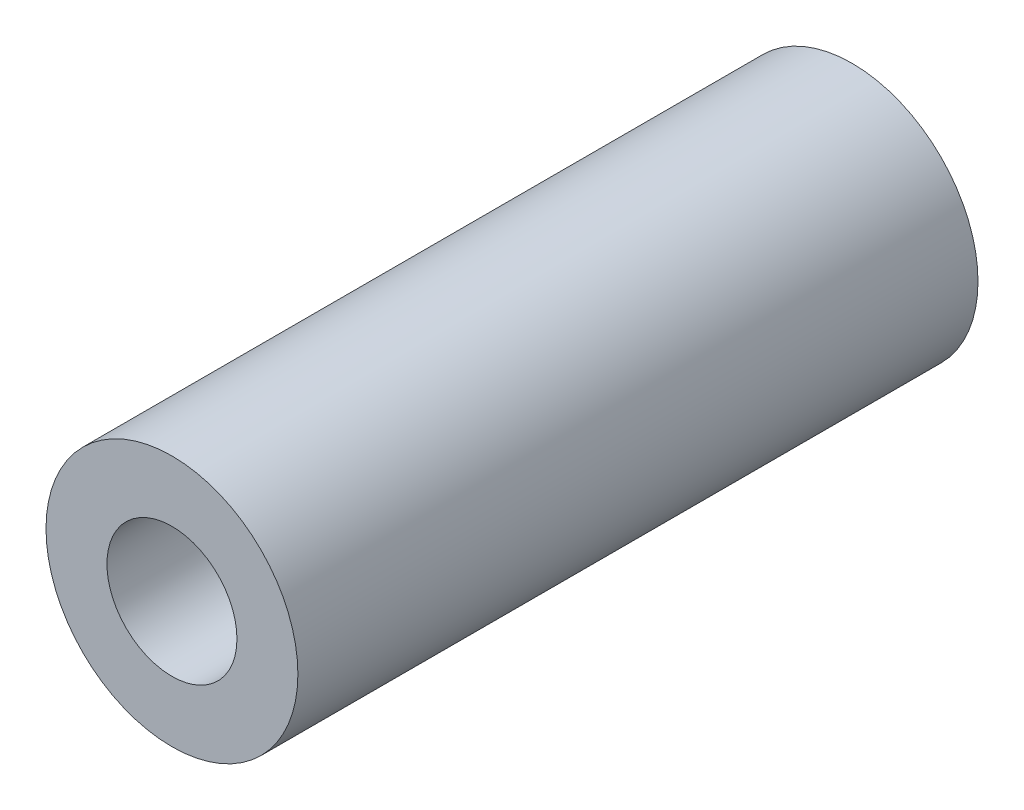
ISO-10303-21;
HEADER;
FILE_DESCRIPTION(('STEP AP214'),'2;1');
FILE_NAME('part.step','',(''),(''),'','','');
FILE_SCHEMA(('AUTOMOTIVE_DESIGN { 1 0 10303 214 1 1 1 1 }'));
ENDSEC;
DATA;
#1=APPLICATION_CONTEXT('core data for automotive mechanical design processes');
#2=APPLICATION_PROTOCOL_DEFINITION('international standard','automotive_design',2000,#1);
#3=PRODUCT_CONTEXT('',#1,'mechanical');
#4=PRODUCT('Part','Part','',(#3));
#5=PRODUCT_RELATED_PRODUCT_CATEGORY('part','',(#4));
#6=PRODUCT_DEFINITION_FORMATION('','',#4);
#7=PRODUCT_DEFINITION_CONTEXT('part definition',#1,'design');
#8=PRODUCT_DEFINITION('design','',#6,#7);
#9=PRODUCT_DEFINITION_SHAPE('','',#8);
#10=(LENGTH_UNIT() NAMED_UNIT(*) SI_UNIT(.MILLI.,.METRE.));
#11=(NAMED_UNIT(*) PLANE_ANGLE_UNIT() SI_UNIT($,.RADIAN.));
#12=(NAMED_UNIT(*) SI_UNIT($,.STERADIAN.) SOLID_ANGLE_UNIT());
#13=UNCERTAINTY_MEASURE_WITH_UNIT(LENGTH_MEASURE(1.E-05),#10,'distance_accuracy_value','');
#14=(GEOMETRIC_REPRESENTATION_CONTEXT(3) GLOBAL_UNCERTAINTY_ASSIGNED_CONTEXT((#13)) GLOBAL_UNIT_ASSIGNED_CONTEXT((#10,
#11,#12)) REPRESENTATION_CONTEXT('',''));
#15=CARTESIAN_POINT('',(0.,0.,0.));
#16=DIRECTION('',(0.,0.,1.));
#17=DIRECTION('',(1.,0.,0.));
#18=AXIS2_PLACEMENT_3D('',#15,#16,#17);
#19=CARTESIAN_POINT('',(16.0166666666667,16.0166666666667,16.74));
#20=DIRECTION('',(0.,0.,1.));
#21=DIRECTION('',(1.,0.,0.));
#22=AXIS2_PLACEMENT_3D('',#19,#20,#21);
#23=PLANE('',#22);
#24=CARTESIAN_POINT('',(16.0166666666667,16.0166666666667,16.74));
#25=DIRECTION('',(0.,0.,1.));
#26=DIRECTION('',(1.,0.,0.));
#27=AXIS2_PLACEMENT_3D('',#24,#25,#26);
#28=CIRCLE('',#27,1.6);
#29=CARTESIAN_POINT('',(17.6166666666667,16.0166666666667,16.74));
#30=VERTEX_POINT('',#29);
#31=EDGE_CURVE('E45',#30,#30,#28,.T.);
#32=ORIENTED_EDGE('',*,*,#31,.F.);
#33=EDGE_LOOP('',(#32));
#34=FACE_BOUND('',#33,.T.);
#35=CARTESIAN_POINT('',(16.0166666666667,16.0166666666667,16.74));
#36=DIRECTION('',(0.,0.,1.));
#37=DIRECTION('',(1.,0.,0.));
#38=AXIS2_PLACEMENT_3D('',#35,#36,#37);
#39=CIRCLE('',#38,3.1);
#40=CARTESIAN_POINT('',(19.1166666666667,16.0166666666667,16.74));
#41=VERTEX_POINT('',#40);
#42=EDGE_CURVE('E10',#41,#41,#39,.T.);
#43=ORIENTED_EDGE('',*,*,#42,.T.);
#44=EDGE_LOOP('',(#43));
#45=FACE_BOUND('',#44,.T.);
#46=ADVANCED_FACE('F30',(#34,#45),#23,.T.);
#47=CARTESIAN_POINT('',(16.0166666666667,16.0166666666667,0.));
#48=DIRECTION('',(0.,0.,1.));
#49=DIRECTION('',(1.,0.,0.));
#50=AXIS2_PLACEMENT_3D('',#47,#48,#49);
#51=PLANE('',#50);
#52=CARTESIAN_POINT('',(16.0166666666667,16.0166666666667,0.));
#53=DIRECTION('',(0.,0.,1.));
#54=DIRECTION('',(1.,0.,0.));
#55=AXIS2_PLACEMENT_3D('',#52,#53,#54);
#56=CIRCLE('',#55,1.6);
#57=CARTESIAN_POINT('',(17.6166666666667,16.0166666666667,0.));
#58=VERTEX_POINT('',#57);
#59=EDGE_CURVE('E41',#58,#58,#56,.T.);
#60=ORIENTED_EDGE('',*,*,#59,.T.);
#61=EDGE_LOOP('',(#60));
#62=FACE_BOUND('',#61,.T.);
#63=CARTESIAN_POINT('',(16.0166666666667,16.0166666666667,0.));
#64=DIRECTION('',(0.,0.,1.));
#65=DIRECTION('',(1.,0.,0.));
#66=AXIS2_PLACEMENT_3D('',#63,#64,#65);
#67=CIRCLE('',#66,3.1);
#68=CARTESIAN_POINT('',(19.1166666666667,16.0166666666667,0.));
#69=VERTEX_POINT('',#68);
#70=EDGE_CURVE('E34',#69,#69,#67,.T.);
#71=ORIENTED_EDGE('',*,*,#70,.F.);
#72=EDGE_LOOP('',(#71));
#73=FACE_BOUND('',#72,.T.);
#74=ADVANCED_FACE('F52',(#62,#73),#51,.F.);
#75=CARTESIAN_POINT('',(16.0166666666667,16.0166666666667,16.74));
#76=DIRECTION('',(0.,0.,-1.));
#77=DIRECTION('',(-1.,0.,0.));
#78=AXIS2_PLACEMENT_3D('',#75,#76,#77);
#79=CYLINDRICAL_SURFACE('',#78,3.1);
#80=ORIENTED_EDGE('',*,*,#42,.F.);
#81=EDGE_LOOP('',(#80));
#82=FACE_BOUND('',#81,.T.);
#83=ORIENTED_EDGE('',*,*,#70,.T.);
#84=EDGE_LOOP('',(#83));
#85=FACE_BOUND('',#84,.T.);
#86=ADVANCED_FACE('F32',(#82,#85),#79,.T.);
#87=CARTESIAN_POINT('',(16.0166666666667,16.0166666666667,16.74));
#88=DIRECTION('',(0.,0.,1.));
#89=DIRECTION('',(1.,0.,0.));
#90=AXIS2_PLACEMENT_3D('',#87,#88,#89);
#91=CYLINDRICAL_SURFACE('',#90,1.6);
#92=ORIENTED_EDGE('',*,*,#59,.F.);
#93=EDGE_LOOP('',(#92));
#94=FACE_BOUND('',#93,.T.);
#95=ORIENTED_EDGE('',*,*,#31,.T.);
#96=EDGE_LOOP('',(#95));
#97=FACE_BOUND('',#96,.T.);
#98=ADVANCED_FACE('F49',(#94,#97),#91,.F.);
#99=CLOSED_SHELL('',(#46,#74,#86,#98));
#100=MANIFOLD_SOLID_BREP('B2',#99);
#101=ADVANCED_BREP_SHAPE_REPRESENTATION('',(#18,#100),#14);
#102=SHAPE_DEFINITION_REPRESENTATION(#9,#101);
ENDSEC;
END-ISO-10303-21;
